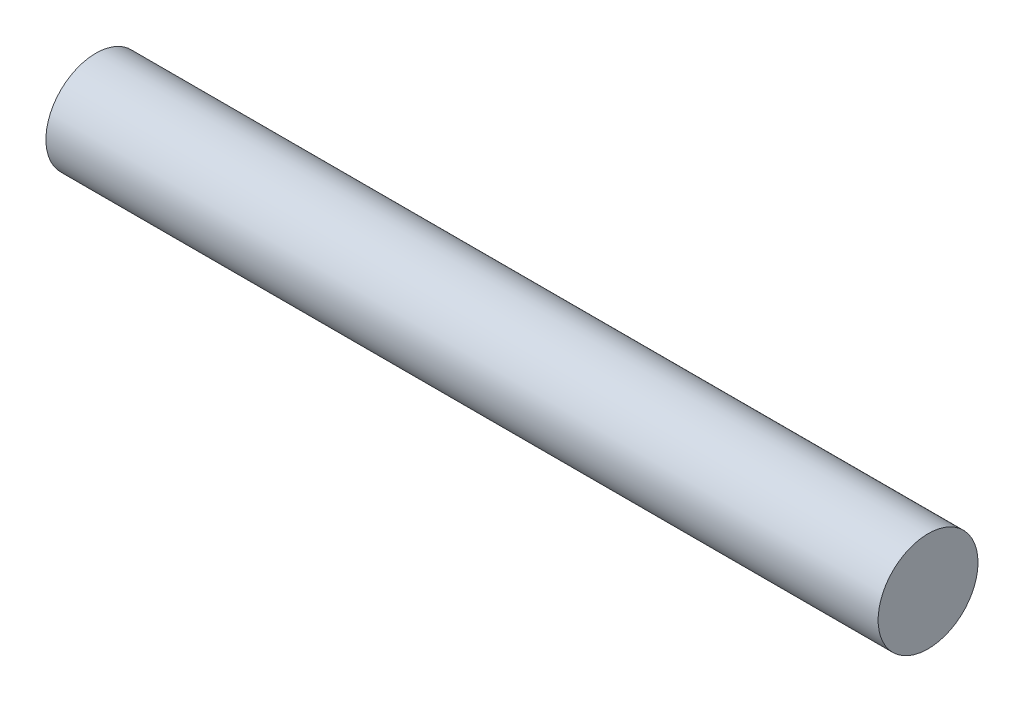
ISO-10303-21;
HEADER;
FILE_DESCRIPTION(('STEP AP214'),'2;1');
FILE_NAME('part.step','',(''),(''),'','','');
FILE_SCHEMA(('AUTOMOTIVE_DESIGN { 1 0 10303 214 1 1 1 1 }'));
ENDSEC;
DATA;
#1=APPLICATION_CONTEXT('core data for automotive mechanical design processes');
#2=APPLICATION_PROTOCOL_DEFINITION('international standard','automotive_design',2000,#1);
#3=PRODUCT_CONTEXT('',#1,'mechanical');
#4=PRODUCT('Part','Part','',(#3));
#5=PRODUCT_RELATED_PRODUCT_CATEGORY('part','',(#4));
#6=PRODUCT_DEFINITION_FORMATION('','',#4);
#7=PRODUCT_DEFINITION_CONTEXT('part definition',#1,'design');
#8=PRODUCT_DEFINITION('design','',#6,#7);
#9=PRODUCT_DEFINITION_SHAPE('','',#8);
#10=(LENGTH_UNIT() NAMED_UNIT(*) SI_UNIT(.MILLI.,.METRE.));
#11=(NAMED_UNIT(*) PLANE_ANGLE_UNIT() SI_UNIT($,.RADIAN.));
#12=(NAMED_UNIT(*) SI_UNIT($,.STERADIAN.) SOLID_ANGLE_UNIT());
#13=UNCERTAINTY_MEASURE_WITH_UNIT(LENGTH_MEASURE(1.E-05),#10,'distance_accuracy_value','');
#14=(GEOMETRIC_REPRESENTATION_CONTEXT(3) GLOBAL_UNCERTAINTY_ASSIGNED_CONTEXT((#13)) GLOBAL_UNIT_ASSIGNED_CONTEXT((#10,
#11,#12)) REPRESENTATION_CONTEXT('',''));
#15=CARTESIAN_POINT('',(0.,0.,0.));
#16=DIRECTION('',(0.,0.,1.));
#17=DIRECTION('',(1.,0.,0.));
#18=AXIS2_PLACEMENT_3D('',#15,#16,#17);
#19=CARTESIAN_POINT('',(-25.,0.,0.));
#20=DIRECTION('',(-1.,0.,0.));
#21=DIRECTION('',(0.,0.,1.));
#22=AXIS2_PLACEMENT_3D('',#19,#20,#21);
#23=PLANE('',#22);
#24=CARTESIAN_POINT('',(-25.,0.,0.));
#25=DIRECTION('',(1.,0.,0.));
#26=DIRECTION('',(0.,0.,-1.));
#27=AXIS2_PLACEMENT_3D('',#24,#25,#26);
#28=CIRCLE('',#27,1.5);
#29=CARTESIAN_POINT('',(-25.,0.,-1.5));
#30=VERTEX_POINT('',#29);
#31=EDGE_CURVE('E10',#30,#30,#28,.T.);
#32=ORIENTED_EDGE('',*,*,#31,.F.);
#33=EDGE_LOOP('',(#32));
#34=FACE_BOUND('',#33,.T.);
#35=ADVANCED_FACE('F35',(#34),#23,.T.);
#36=CARTESIAN_POINT('',(28.0973326946063,0.,0.));
#37=DIRECTION('',(1.,0.,0.));
#38=DIRECTION('',(0.,0.,-1.));
#39=AXIS2_PLACEMENT_3D('',#36,#37,#38);
#40=CYLINDRICAL_SURFACE('',#39,1.5);
#41=ORIENTED_EDGE('',*,*,#31,.T.);
#42=EDGE_LOOP('',(#41));
#43=FACE_BOUND('',#42,.T.);
#44=CARTESIAN_POINT('',(0.,0.,0.));
#45=DIRECTION('',(1.,0.,0.));
#46=DIRECTION('',(0.,0.,-1.));
#47=AXIS2_PLACEMENT_3D('',#44,#45,#46);
#48=CIRCLE('',#47,1.5);
#49=CARTESIAN_POINT('',(0.,0.,-1.5));
#50=VERTEX_POINT('',#49);
#51=EDGE_CURVE('E41',#50,#50,#48,.T.);
#52=ORIENTED_EDGE('',*,*,#51,.F.);
#53=EDGE_LOOP('',(#52));
#54=FACE_BOUND('',#53,.T.);
#55=ADVANCED_FACE('F49',(#43,#54),#40,.T.);
#56=CARTESIAN_POINT('',(0.,1.5,0.));
#57=DIRECTION('',(1.,0.,0.));
#58=DIRECTION('',(0.,0.,-1.));
#59=AXIS2_PLACEMENT_3D('',#56,#57,#58);
#60=PLANE('',#59);
#61=ORIENTED_EDGE('',*,*,#51,.T.);
#62=EDGE_LOOP('',(#61));
#63=FACE_BOUND('',#62,.T.);
#64=ADVANCED_FACE('F47',(#63),#60,.T.);
#65=CLOSED_SHELL('',(#35,#55,#64));
#66=MANIFOLD_SOLID_BREP('B2',#65);
#67=ADVANCED_BREP_SHAPE_REPRESENTATION('',(#18,#66),#14);
#68=SHAPE_DEFINITION_REPRESENTATION(#9,#67);
ENDSEC;
END-ISO-10303-21;
